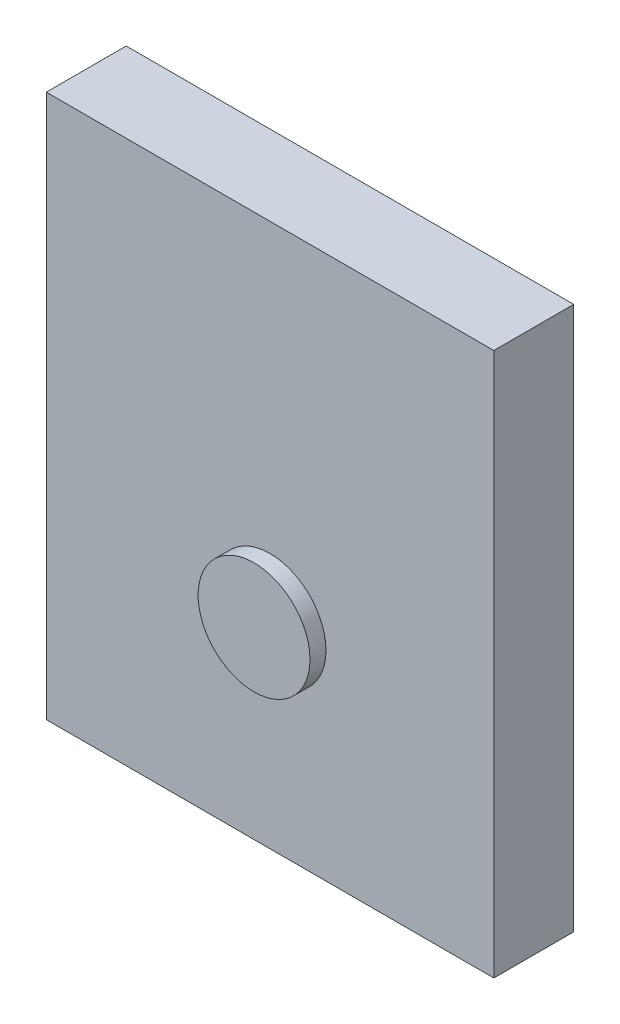
ISO-10303-21;
HEADER;
FILE_DESCRIPTION(('STEP AP214'),'2;1');
FILE_NAME('part.step','',(''),(''),'','','');
FILE_SCHEMA(('AUTOMOTIVE_DESIGN { 1 0 10303 214 1 1 1 1 }'));
ENDSEC;
DATA;
#1=APPLICATION_CONTEXT('core data for automotive mechanical design processes');
#2=APPLICATION_PROTOCOL_DEFINITION('international standard','automotive_design',2000,#1);
#3=PRODUCT_CONTEXT('',#1,'mechanical');
#4=PRODUCT('Part','Part','',(#3));
#5=PRODUCT_RELATED_PRODUCT_CATEGORY('part','',(#4));
#6=PRODUCT_DEFINITION_FORMATION('','',#4);
#7=PRODUCT_DEFINITION_CONTEXT('part definition',#1,'design');
#8=PRODUCT_DEFINITION('design','',#6,#7);
#9=PRODUCT_DEFINITION_SHAPE('','',#8);
#10=(LENGTH_UNIT() NAMED_UNIT(*) SI_UNIT(.MILLI.,.METRE.));
#11=(NAMED_UNIT(*) PLANE_ANGLE_UNIT() SI_UNIT($,.RADIAN.));
#12=(NAMED_UNIT(*) SI_UNIT($,.STERADIAN.) SOLID_ANGLE_UNIT());
#13=UNCERTAINTY_MEASURE_WITH_UNIT(LENGTH_MEASURE(1.E-05),#10,'distance_accuracy_value','');
#14=(GEOMETRIC_REPRESENTATION_CONTEXT(3) GLOBAL_UNCERTAINTY_ASSIGNED_CONTEXT((#13)) GLOBAL_UNIT_ASSIGNED_CONTEXT((#10,
#11,#12)) REPRESENTATION_CONTEXT('',''));
#15=CARTESIAN_POINT('',(0.,0.,0.));
#16=DIRECTION('',(0.,0.,1.));
#17=DIRECTION('',(1.,0.,0.));
#18=AXIS2_PLACEMENT_3D('',#15,#16,#17);
#19=CARTESIAN_POINT('',(8.50202256693873,26.3979293871463,10.));
#20=DIRECTION('',(1.,0.,0.));
#21=DIRECTION('',(0.,1.,0.));
#22=AXIS2_PLACEMENT_3D('',#19,#20,#21);
#23=PLANE('',#22);
#24=DIRECTION('',(0.,-1.,0.));
#25=VECTOR('',#24,1.);
#26=CARTESIAN_POINT('',(8.50202256693873,26.3979293871463,0.));
#27=LINE('',#26,#25);
#28=CARTESIAN_POINT('',(8.50202256693873,26.3979293871463,0.));
#29=VERTEX_POINT('',#28);
#30=CARTESIAN_POINT('',(8.50202256693874,-41.6020706128537,0.));
#31=VERTEX_POINT('',#30);
#32=EDGE_CURVE('E102',#29,#31,#27,.T.);
#33=ORIENTED_EDGE('',*,*,#32,.T.);
#34=DIRECTION('',(0.,0.,-1.));
#35=VECTOR('',#34,1.);
#36=CARTESIAN_POINT('',(8.50202256693874,-41.6020706128537,10.));
#37=LINE('',#36,#35);
#38=CARTESIAN_POINT('',(8.50202256693874,-41.6020706128537,10.));
#39=VERTEX_POINT('',#38);
#40=EDGE_CURVE('E11',#39,#31,#37,.T.);
#41=ORIENTED_EDGE('',*,*,#40,.F.);
#42=DIRECTION('',(0.,-1.,0.));
#43=VECTOR('',#42,1.);
#44=CARTESIAN_POINT('',(8.50202256693873,26.3979293871463,10.));
#45=LINE('',#44,#43);
#46=CARTESIAN_POINT('',(8.50202256693873,26.3979293871463,10.));
#47=VERTEX_POINT('',#46);
#48=EDGE_CURVE('E90',#47,#39,#45,.T.);
#49=ORIENTED_EDGE('',*,*,#48,.F.);
#50=DIRECTION('',(0.,0.,-1.));
#51=VECTOR('',#50,1.);
#52=CARTESIAN_POINT('',(8.50202256693873,26.3979293871463,10.));
#53=LINE('',#52,#51);
#54=EDGE_CURVE('E98',#47,#29,#53,.T.);
#55=ORIENTED_EDGE('',*,*,#54,.T.);
#56=EDGE_LOOP('',(#33,#41,#49,#55));
#57=FACE_BOUND('',#56,.T.);
#58=ADVANCED_FACE('F39',(#57),#23,.F.);
#59=CARTESIAN_POINT('',(8.50202256693874,-41.6020706128537,10.));
#60=DIRECTION('',(0.,1.,0.));
#61=DIRECTION('',(0.,0.,1.));
#62=AXIS2_PLACEMENT_3D('',#59,#60,#61);
#63=PLANE('',#62);
#64=DIRECTION('',(1.,0.,0.));
#65=VECTOR('',#64,1.);
#66=CARTESIAN_POINT('',(8.50202256693874,-41.6020706128537,0.));
#67=LINE('',#66,#65);
#68=CARTESIAN_POINT('',(64.5020225669387,-41.6020706128537,0.));
#69=VERTEX_POINT('',#68);
#70=EDGE_CURVE('E94',#31,#69,#67,.T.);
#71=ORIENTED_EDGE('',*,*,#70,.T.);
#72=DIRECTION('',(0.,0.,-1.));
#73=VECTOR('',#72,1.);
#74=CARTESIAN_POINT('',(64.5020225669387,-41.6020706128537,10.));
#75=LINE('',#74,#73);
#76=CARTESIAN_POINT('',(64.5020225669387,-41.6020706128537,10.));
#77=VERTEX_POINT('',#76);
#78=EDGE_CURVE('E47',#77,#69,#75,.T.);
#79=ORIENTED_EDGE('',*,*,#78,.F.);
#80=DIRECTION('',(1.,0.,0.));
#81=VECTOR('',#80,1.);
#82=CARTESIAN_POINT('',(8.50202256693874,-41.6020706128537,10.));
#83=LINE('',#82,#81);
#84=EDGE_CURVE('E85',#39,#77,#83,.T.);
#85=ORIENTED_EDGE('',*,*,#84,.F.);
#86=ORIENTED_EDGE('',*,*,#40,.T.);
#87=EDGE_LOOP('',(#71,#79,#85,#86));
#88=FACE_BOUND('',#87,.T.);
#89=ADVANCED_FACE('F93',(#88),#63,.F.);
#90=CARTESIAN_POINT('',(64.5020225669387,26.3979293871463,10.));
#91=DIRECTION('',(-1.,0.,0.));
#92=DIRECTION('',(0.,-1.,0.));
#93=AXIS2_PLACEMENT_3D('',#90,#91,#92);
#94=PLANE('',#93);
#95=DIRECTION('',(0.,1.,0.));
#96=VECTOR('',#95,1.);
#97=CARTESIAN_POINT('',(64.5020225669387,26.3979293871463,0.));
#98=LINE('',#97,#96);
#99=CARTESIAN_POINT('',(64.5020225669387,26.3979293871463,0.));
#100=VERTEX_POINT('',#99);
#101=EDGE_CURVE('E72',#69,#100,#98,.T.);
#102=ORIENTED_EDGE('',*,*,#101,.T.);
#103=DIRECTION('',(0.,0.,-1.));
#104=VECTOR('',#103,1.);
#105=CARTESIAN_POINT('',(64.5020225669387,26.3979293871463,10.));
#106=LINE('',#105,#104);
#107=CARTESIAN_POINT('',(64.5020225669387,26.3979293871463,10.));
#108=VERTEX_POINT('',#107);
#109=EDGE_CURVE('E95',#108,#100,#106,.T.);
#110=ORIENTED_EDGE('',*,*,#109,.F.);
#111=DIRECTION('',(0.,1.,0.));
#112=VECTOR('',#111,1.);
#113=CARTESIAN_POINT('',(64.5020225669387,26.3979293871463,10.));
#114=LINE('',#113,#112);
#115=EDGE_CURVE('E88',#77,#108,#114,.T.);
#116=ORIENTED_EDGE('',*,*,#115,.F.);
#117=ORIENTED_EDGE('',*,*,#78,.T.);
#118=EDGE_LOOP('',(#102,#110,#116,#117));
#119=FACE_BOUND('',#118,.T.);
#120=ADVANCED_FACE('F96',(#119),#94,.F.);
#121=CARTESIAN_POINT('',(8.50202256693873,26.3979293871463,10.));
#122=DIRECTION('',(0.,-1.,0.));
#123=DIRECTION('',(0.,0.,-1.));
#124=AXIS2_PLACEMENT_3D('',#121,#122,#123);
#125=PLANE('',#124);
#126=DIRECTION('',(-1.,0.,0.));
#127=VECTOR('',#126,1.);
#128=CARTESIAN_POINT('',(8.50202256693873,26.3979293871463,0.));
#129=LINE('',#128,#127);
#130=EDGE_CURVE('E78',#100,#29,#129,.T.);
#131=ORIENTED_EDGE('',*,*,#130,.T.);
#132=ORIENTED_EDGE('',*,*,#54,.F.);
#133=DIRECTION('',(-1.,0.,0.));
#134=VECTOR('',#133,1.);
#135=CARTESIAN_POINT('',(8.50202256693873,26.3979293871463,10.));
#136=LINE('',#135,#134);
#137=EDGE_CURVE('E55',#108,#47,#136,.T.);
#138=ORIENTED_EDGE('',*,*,#137,.F.);
#139=ORIENTED_EDGE('',*,*,#109,.T.);
#140=EDGE_LOOP('',(#131,#132,#138,#139));
#141=FACE_BOUND('',#140,.T.);
#142=ADVANCED_FACE('F110',(#141),#125,.F.);
#143=CARTESIAN_POINT('',(0.,0.,10.));
#144=DIRECTION('',(0.,0.,1.));
#145=DIRECTION('',(1.,0.,0.));
#146=AXIS2_PLACEMENT_3D('',#143,#144,#145);
#147=PLANE('',#146);
#148=CARTESIAN_POINT('',(36.5020225669387,-16.6020706128537,10.));
#149=DIRECTION('',(0.,0.,1.));
#150=DIRECTION('',(1.,0.,0.));
#151=AXIS2_PLACEMENT_3D('',#148,#149,#150);
#152=CIRCLE('',#151,7.);
#153=CARTESIAN_POINT('',(43.5020225669387,-16.6020706128537,10.));
#154=VERTEX_POINT('',#153);
#155=EDGE_CURVE('E116',#154,#154,#152,.T.);
#156=ORIENTED_EDGE('',*,*,#155,.F.);
#157=EDGE_LOOP('',(#156));
#158=FACE_BOUND('',#157,.T.);
#159=ORIENTED_EDGE('',*,*,#48,.T.);
#160=ORIENTED_EDGE('',*,*,#84,.T.);
#161=ORIENTED_EDGE('',*,*,#115,.T.);
#162=ORIENTED_EDGE('',*,*,#137,.T.);
#163=EDGE_LOOP('',(#159,#160,#161,#162));
#164=FACE_BOUND('',#163,.T.);
#165=ADVANCED_FACE('F86',(#158,#164),#147,.T.);
#166=CARTESIAN_POINT('',(0.,0.,0.));
#167=DIRECTION('',(0.,0.,1.));
#168=DIRECTION('',(1.,0.,0.));
#169=AXIS2_PLACEMENT_3D('',#166,#167,#168);
#170=PLANE('',#169);
#171=ORIENTED_EDGE('',*,*,#32,.F.);
#172=ORIENTED_EDGE('',*,*,#130,.F.);
#173=ORIENTED_EDGE('',*,*,#101,.F.);
#174=ORIENTED_EDGE('',*,*,#70,.F.);
#175=EDGE_LOOP('',(#171,#172,#173,#174));
#176=FACE_BOUND('',#175,.T.);
#177=ADVANCED_FACE('F113',(#176),#170,.F.);
#178=CARTESIAN_POINT('',(36.5020225669387,-16.6020706128537,12.));
#179=DIRECTION('',(0.,0.,-1.));
#180=DIRECTION('',(-1.,0.,0.));
#181=AXIS2_PLACEMENT_3D('',#178,#179,#180);
#182=CYLINDRICAL_SURFACE('',#181,7.);
#183=CARTESIAN_POINT('',(36.5020225669387,-16.6020706128537,12.));
#184=DIRECTION('',(0.,0.,1.));
#185=DIRECTION('',(1.,0.,0.));
#186=AXIS2_PLACEMENT_3D('',#183,#184,#185);
#187=CIRCLE('',#186,7.);
#188=CARTESIAN_POINT('',(43.5020225669387,-16.6020706128537,12.));
#189=VERTEX_POINT('',#188);
#190=EDGE_CURVE('E105',#189,#189,#187,.T.);
#191=ORIENTED_EDGE('',*,*,#190,.F.);
#192=EDGE_LOOP('',(#191));
#193=FACE_BOUND('',#192,.T.);
#194=ORIENTED_EDGE('',*,*,#155,.T.);
#195=EDGE_LOOP('',(#194));
#196=FACE_BOUND('',#195,.T.);
#197=ADVANCED_FACE('F124',(#193,#196),#182,.T.);
#198=CARTESIAN_POINT('',(36.5020225669387,-16.6020706128537,12.));
#199=DIRECTION('',(0.,0.,1.));
#200=DIRECTION('',(1.,0.,0.));
#201=AXIS2_PLACEMENT_3D('',#198,#199,#200);
#202=PLANE('',#201);
#203=ORIENTED_EDGE('',*,*,#190,.T.);
#204=EDGE_LOOP('',(#203));
#205=FACE_BOUND('',#204,.T.);
#206=ADVANCED_FACE('F122',(#205),#202,.T.);
#207=CLOSED_SHELL('',(#58,#89,#120,#142,#165,#177,#197,#206));
#208=MANIFOLD_SOLID_BREP('B2',#207);
#209=ADVANCED_BREP_SHAPE_REPRESENTATION('',(#18,#208),#14);
#210=SHAPE_DEFINITION_REPRESENTATION(#9,#209);
ENDSEC;
END-ISO-10303-21;
